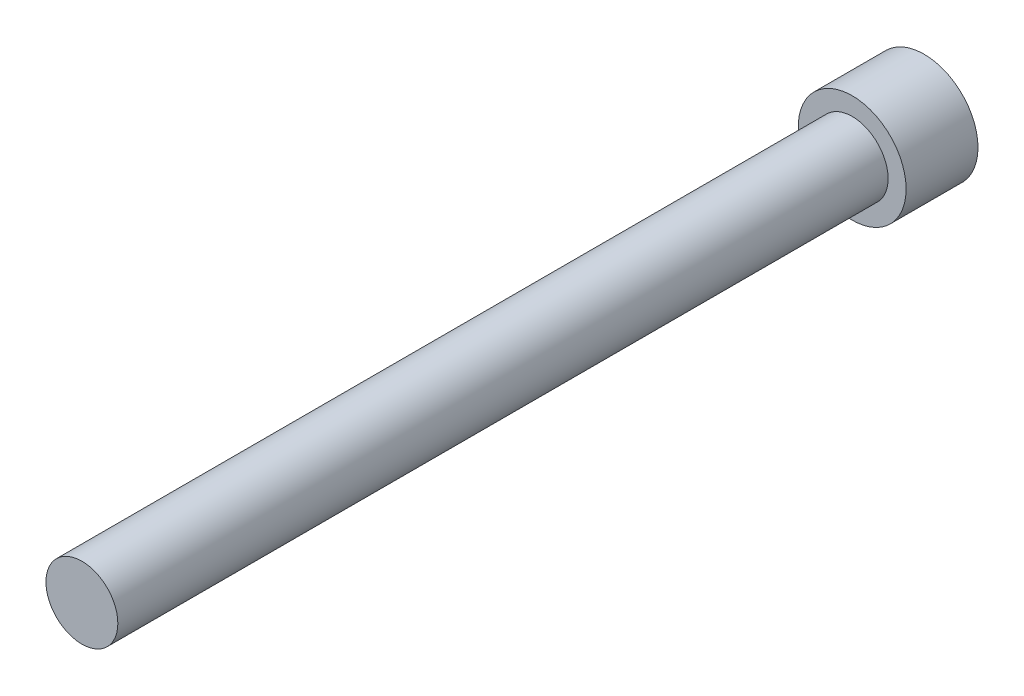
ISO-10303-21;
HEADER;
FILE_DESCRIPTION(('STEP AP214'),'2;1');
FILE_NAME('part.step','',(''),(''),'','','');
FILE_SCHEMA(('AUTOMOTIVE_DESIGN { 1 0 10303 214 1 1 1 1 }'));
ENDSEC;
DATA;
#1=APPLICATION_CONTEXT('core data for automotive mechanical design processes');
#2=APPLICATION_PROTOCOL_DEFINITION('international standard','automotive_design',2000,#1);
#3=PRODUCT_CONTEXT('',#1,'mechanical');
#4=PRODUCT('Part','Part','',(#3));
#5=PRODUCT_RELATED_PRODUCT_CATEGORY('part','',(#4));
#6=PRODUCT_DEFINITION_FORMATION('','',#4);
#7=PRODUCT_DEFINITION_CONTEXT('part definition',#1,'design');
#8=PRODUCT_DEFINITION('design','',#6,#7);
#9=PRODUCT_DEFINITION_SHAPE('','',#8);
#10=(LENGTH_UNIT() NAMED_UNIT(*) SI_UNIT(.MILLI.,.METRE.));
#11=(NAMED_UNIT(*) PLANE_ANGLE_UNIT() SI_UNIT($,.RADIAN.));
#12=(NAMED_UNIT(*) SI_UNIT($,.STERADIAN.) SOLID_ANGLE_UNIT());
#13=UNCERTAINTY_MEASURE_WITH_UNIT(LENGTH_MEASURE(1.E-05),#10,'distance_accuracy_value','');
#14=(GEOMETRIC_REPRESENTATION_CONTEXT(3) GLOBAL_UNCERTAINTY_ASSIGNED_CONTEXT((#13)) GLOBAL_UNIT_ASSIGNED_CONTEXT((#10,
#11,#12)) REPRESENTATION_CONTEXT('',''));
#15=CARTESIAN_POINT('',(0.,0.,0.));
#16=DIRECTION('',(0.,0.,1.));
#17=DIRECTION('',(1.,0.,0.));
#18=AXIS2_PLACEMENT_3D('',#15,#16,#17);
#19=CARTESIAN_POINT('',(-16.4104837985818,16.5449959608653,14.));
#20=DIRECTION('',(0.,0.,-1.));
#21=DIRECTION('',(-1.,0.,0.));
#22=AXIS2_PLACEMENT_3D('',#19,#20,#21);
#23=CYLINDRICAL_SURFACE('',#22,10.5);
#24=CARTESIAN_POINT('',(-16.4104837985818,16.5449959608653,14.));
#25=DIRECTION('',(0.,0.,1.));
#26=DIRECTION('',(1.,0.,0.));
#27=AXIS2_PLACEMENT_3D('',#24,#25,#26);
#28=CIRCLE('',#27,10.5);
#29=CARTESIAN_POINT('',(-5.91048379858179,16.5449959608653,14.));
#30=VERTEX_POINT('',#29);
#31=EDGE_CURVE('E43',#30,#30,#28,.T.);
#32=ORIENTED_EDGE('',*,*,#31,.F.);
#33=EDGE_LOOP('',(#32));
#34=FACE_BOUND('',#33,.T.);
#35=CARTESIAN_POINT('',(-16.4104837985818,16.5449959608653,0.));
#36=DIRECTION('',(0.,0.,1.));
#37=DIRECTION('',(1.,0.,0.));
#38=AXIS2_PLACEMENT_3D('',#35,#36,#37);
#39=CIRCLE('',#38,10.5);
#40=CARTESIAN_POINT('',(-5.91048379858179,16.5449959608653,0.));
#41=VERTEX_POINT('',#40);
#42=EDGE_CURVE('E39',#41,#41,#39,.T.);
#43=ORIENTED_EDGE('',*,*,#42,.T.);
#44=EDGE_LOOP('',(#43));
#45=FACE_BOUND('',#44,.T.);
#46=ADVANCED_FACE('F36',(#34,#45),#23,.T.);
#47=CARTESIAN_POINT('',(-16.4104837985818,16.5449959608653,14.));
#48=DIRECTION('',(0.,0.,1.));
#49=DIRECTION('',(1.,0.,0.));
#50=AXIS2_PLACEMENT_3D('',#47,#48,#49);
#51=PLANE('',#50);
#52=CARTESIAN_POINT('',(-16.4104837985818,16.5449959608653,14.));
#53=DIRECTION('',(0.,0.,1.));
#54=DIRECTION('',(1.,0.,0.));
#55=AXIS2_PLACEMENT_3D('',#52,#53,#54);
#56=CIRCLE('',#55,7.);
#57=CARTESIAN_POINT('',(-9.41048379858179,16.5449959608653,14.));
#58=VERTEX_POINT('',#57);
#59=EDGE_CURVE('E10',#58,#58,#56,.T.);
#60=ORIENTED_EDGE('',*,*,#59,.F.);
#61=EDGE_LOOP('',(#60));
#62=FACE_BOUND('',#61,.T.);
#63=ORIENTED_EDGE('',*,*,#31,.T.);
#64=EDGE_LOOP('',(#63));
#65=FACE_BOUND('',#64,.T.);
#66=ADVANCED_FACE('F60',(#62,#65),#51,.T.);
#67=CARTESIAN_POINT('',(-16.4104837985818,16.5449959608653,0.));
#68=DIRECTION('',(0.,0.,1.));
#69=DIRECTION('',(1.,0.,0.));
#70=AXIS2_PLACEMENT_3D('',#67,#68,#69);
#71=PLANE('',#70);
#72=ORIENTED_EDGE('',*,*,#42,.F.);
#73=EDGE_LOOP('',(#72));
#74=FACE_BOUND('',#73,.T.);
#75=ADVANCED_FACE('F57',(#74),#71,.F.);
#76=CARTESIAN_POINT('',(-16.4104837985818,16.5449959608653,164.));
#77=DIRECTION('',(0.,0.,-1.));
#78=DIRECTION('',(-1.,0.,0.));
#79=AXIS2_PLACEMENT_3D('',#76,#77,#78);
#80=CYLINDRICAL_SURFACE('',#79,7.);
#81=CARTESIAN_POINT('',(-16.4104837985818,16.5449959608653,164.));
#82=DIRECTION('',(0.,0.,1.));
#83=DIRECTION('',(1.,0.,0.));
#84=AXIS2_PLACEMENT_3D('',#81,#82,#83);
#85=CIRCLE('',#84,7.);
#86=CARTESIAN_POINT('',(-9.41048379858179,16.5449959608653,164.));
#87=VERTEX_POINT('',#86);
#88=EDGE_CURVE('E49',#87,#87,#85,.T.);
#89=ORIENTED_EDGE('',*,*,#88,.F.);
#90=EDGE_LOOP('',(#89));
#91=FACE_BOUND('',#90,.T.);
#92=ORIENTED_EDGE('',*,*,#59,.T.);
#93=EDGE_LOOP('',(#92));
#94=FACE_BOUND('',#93,.T.);
#95=ADVANCED_FACE('F59',(#91,#94),#80,.T.);
#96=CARTESIAN_POINT('',(-16.4104837985818,16.5449959608653,164.));
#97=DIRECTION('',(0.,0.,1.));
#98=DIRECTION('',(1.,0.,0.));
#99=AXIS2_PLACEMENT_3D('',#96,#97,#98);
#100=PLANE('',#99);
#101=ORIENTED_EDGE('',*,*,#88,.T.);
#102=EDGE_LOOP('',(#101));
#103=FACE_BOUND('',#102,.T.);
#104=ADVANCED_FACE('F65',(#103),#100,.T.);
#105=CLOSED_SHELL('',(#46,#66,#75,#95,#104));
#106=MANIFOLD_SOLID_BREP('B2',#105);
#107=ADVANCED_BREP_SHAPE_REPRESENTATION('',(#18,#106),#14);
#108=SHAPE_DEFINITION_REPRESENTATION(#9,#107);
ENDSEC;
END-ISO-10303-21;
